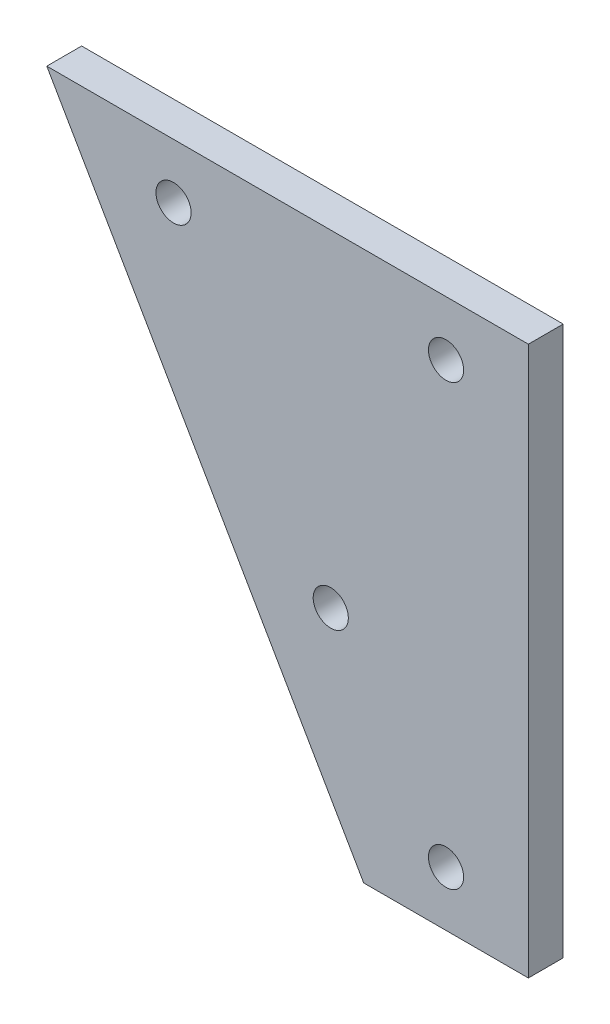
ISO-10303-21;
HEADER;
FILE_DESCRIPTION(('STEP AP214'),'2;1');
FILE_NAME('part.step','',(''),(''),'','','');
FILE_SCHEMA(('AUTOMOTIVE_DESIGN { 1 0 10303 214 1 1 1 1 }'));
ENDSEC;
DATA;
#1=APPLICATION_CONTEXT('core data for automotive mechanical design processes');
#2=APPLICATION_PROTOCOL_DEFINITION('international standard','automotive_design',2000,#1);
#3=PRODUCT_CONTEXT('',#1,'mechanical');
#4=PRODUCT('Part','Part','',(#3));
#5=PRODUCT_RELATED_PRODUCT_CATEGORY('part','',(#4));
#6=PRODUCT_DEFINITION_FORMATION('','',#4);
#7=PRODUCT_DEFINITION_CONTEXT('part definition',#1,'design');
#8=PRODUCT_DEFINITION('design','',#6,#7);
#9=PRODUCT_DEFINITION_SHAPE('','',#8);
#10=(LENGTH_UNIT() NAMED_UNIT(*) SI_UNIT(.MILLI.,.METRE.));
#11=(NAMED_UNIT(*) PLANE_ANGLE_UNIT() SI_UNIT($,.RADIAN.));
#12=(NAMED_UNIT(*) SI_UNIT($,.STERADIAN.) SOLID_ANGLE_UNIT());
#13=UNCERTAINTY_MEASURE_WITH_UNIT(LENGTH_MEASURE(1.E-05),#10,'distance_accuracy_value','');
#14=(GEOMETRIC_REPRESENTATION_CONTEXT(3) GLOBAL_UNCERTAINTY_ASSIGNED_CONTEXT((#13)) GLOBAL_UNIT_ASSIGNED_CONTEXT((#10,
#11,#12)) REPRESENTATION_CONTEXT('',''));
#15=CARTESIAN_POINT('',(0.,0.,0.));
#16=DIRECTION('',(0.,0.,1.));
#17=DIRECTION('',(1.,0.,0.));
#18=AXIS2_PLACEMENT_3D('',#15,#16,#17);
#19=CARTESIAN_POINT('',(0.,0.,3.175));
#20=DIRECTION('',(0.,0.,-1.));
#21=DIRECTION('',(-1.,0.,0.));
#22=AXIS2_PLACEMENT_3D('',#19,#20,#21);
#23=PLANE('',#22);
#24=DIRECTION('',(0.499999999999995,-0.866025403784441,0.));
#25=VECTOR('',#24,1.);
#26=CARTESIAN_POINT('',(28.8675134594809,-50.,3.175));
#27=LINE('',#26,#25);
#28=CARTESIAN_POINT('',(0.,0.,3.175));
#29=VERTEX_POINT('',#28);
#30=CARTESIAN_POINT('',(28.8675134594809,-50.,3.175));
#31=VERTEX_POINT('',#30);
#32=EDGE_CURVE('E98',#29,#31,#27,.T.);
#33=ORIENTED_EDGE('',*,*,#32,.T.);
#34=DIRECTION('',(1.,0.,0.));
#35=VECTOR('',#34,1.);
#36=CARTESIAN_POINT('',(43.8675134594809,-50.,3.175));
#37=LINE('',#36,#35);
#38=CARTESIAN_POINT('',(43.8675134594809,-50.,3.175));
#39=VERTEX_POINT('',#38);
#40=EDGE_CURVE('E93',#31,#39,#37,.T.);
#41=ORIENTED_EDGE('',*,*,#40,.T.);
#42=DIRECTION('',(0.,1.,0.));
#43=VECTOR('',#42,1.);
#44=CARTESIAN_POINT('',(43.8675134594809,0.,3.175));
#45=LINE('',#44,#43);
#46=CARTESIAN_POINT('',(43.8675134594809,0.,3.175));
#47=VERTEX_POINT('',#46);
#48=EDGE_CURVE('E96',#39,#47,#45,.T.);
#49=ORIENTED_EDGE('',*,*,#48,.T.);
#50=DIRECTION('',(-1.,0.,0.));
#51=VECTOR('',#50,1.);
#52=CARTESIAN_POINT('',(0.,0.,3.175));
#53=LINE('',#52,#51);
#54=EDGE_CURVE('E63',#47,#29,#53,.T.);
#55=ORIENTED_EDGE('',*,*,#54,.T.);
#56=EDGE_LOOP('',(#33,#41,#49,#55));
#57=FACE_BOUND('',#56,.T.);
#58=CARTESIAN_POINT('',(36.3675134594809,-5.,3.175));
#59=DIRECTION('',(0.,0.,1.));
#60=DIRECTION('',(1.,0.,0.));
#61=AXIS2_PLACEMENT_3D('',#58,#59,#60);
#62=CIRCLE('',#61,1.6);
#63=CARTESIAN_POINT('',(37.9675134594809,-5.,3.175));
#64=VERTEX_POINT('',#63);
#65=EDGE_CURVE('E118',#64,#64,#62,.T.);
#66=ORIENTED_EDGE('',*,*,#65,.F.);
#67=EDGE_LOOP('',(#66));
#68=FACE_BOUND('',#67,.T.);
#69=CARTESIAN_POINT('',(11.5470053837924,-5.,3.175));
#70=DIRECTION('',(0.,0.,1.));
#71=DIRECTION('',(1.,0.,0.));
#72=AXIS2_PLACEMENT_3D('',#69,#70,#71);
#73=CIRCLE('',#72,1.6);
#74=CARTESIAN_POINT('',(13.1470053837925,-5.,3.175));
#75=VERTEX_POINT('',#74);
#76=EDGE_CURVE('E140',#75,#75,#73,.T.);
#77=ORIENTED_EDGE('',*,*,#76,.F.);
#78=EDGE_LOOP('',(#77));
#79=FACE_BOUND('',#78,.T.);
#80=CARTESIAN_POINT('',(36.3675134594809,-45.,3.175));
#81=DIRECTION('',(0.,0.,1.));
#82=DIRECTION('',(1.,0.,0.));
#83=AXIS2_PLACEMENT_3D('',#80,#81,#82);
#84=CIRCLE('',#83,1.60000000000001);
#85=CARTESIAN_POINT('',(37.9675134594809,-45.,3.175));
#86=VERTEX_POINT('',#85);
#87=EDGE_CURVE('E148',#86,#86,#84,.T.);
#88=ORIENTED_EDGE('',*,*,#87,.F.);
#89=EDGE_LOOP('',(#88));
#90=FACE_BOUND('',#89,.T.);
#91=CARTESIAN_POINT('',(25.8675134594809,-29.8038475772932,3.175));
#92=DIRECTION('',(0.,0.,1.));
#93=DIRECTION('',(1.,0.,0.));
#94=AXIS2_PLACEMENT_3D('',#91,#92,#93);
#95=CIRCLE('',#94,1.60000000000002);
#96=CARTESIAN_POINT('',(27.4675134594809,-29.8038475772932,3.175));
#97=VERTEX_POINT('',#96);
#98=EDGE_CURVE('E156',#97,#97,#95,.T.);
#99=ORIENTED_EDGE('',*,*,#98,.F.);
#100=EDGE_LOOP('',(#99));
#101=FACE_BOUND('',#100,.T.);
#102=ADVANCED_FACE('F45',(#57,#68,#79,#90,#101),#23,.F.);
#103=CARTESIAN_POINT('',(0.,0.,0.));
#104=DIRECTION('',(0.,0.,-1.));
#105=DIRECTION('',(-1.,0.,0.));
#106=AXIS2_PLACEMENT_3D('',#103,#104,#105);
#107=PLANE('',#106);
#108=CARTESIAN_POINT('',(36.3675134594809,-45.,0.));
#109=DIRECTION('',(0.,0.,1.));
#110=DIRECTION('',(1.,0.,0.));
#111=AXIS2_PLACEMENT_3D('',#108,#109,#110);
#112=CIRCLE('',#111,1.60000000000001);
#113=CARTESIAN_POINT('',(37.9675134594809,-45.,0.));
#114=VERTEX_POINT('',#113);
#115=EDGE_CURVE('E152',#114,#114,#112,.T.);
#116=ORIENTED_EDGE('',*,*,#115,.T.);
#117=EDGE_LOOP('',(#116));
#118=FACE_BOUND('',#117,.T.);
#119=CARTESIAN_POINT('',(36.3675134594809,-5.,0.));
#120=DIRECTION('',(0.,0.,1.));
#121=DIRECTION('',(1.,0.,0.));
#122=AXIS2_PLACEMENT_3D('',#119,#120,#121);
#123=CIRCLE('',#122,1.6);
#124=CARTESIAN_POINT('',(37.9675134594809,-5.,0.));
#125=VERTEX_POINT('',#124);
#126=EDGE_CURVE('E136',#125,#125,#123,.T.);
#127=ORIENTED_EDGE('',*,*,#126,.T.);
#128=EDGE_LOOP('',(#127));
#129=FACE_BOUND('',#128,.T.);
#130=DIRECTION('',(0.499999999999995,-0.866025403784441,0.));
#131=VECTOR('',#130,1.);
#132=CARTESIAN_POINT('',(28.8675134594809,-50.,0.));
#133=LINE('',#132,#131);
#134=CARTESIAN_POINT('',(0.,0.,0.));
#135=VERTEX_POINT('',#134);
#136=CARTESIAN_POINT('',(28.8675134594809,-50.,0.));
#137=VERTEX_POINT('',#136);
#138=EDGE_CURVE('E114',#135,#137,#133,.T.);
#139=ORIENTED_EDGE('',*,*,#138,.F.);
#140=DIRECTION('',(-1.,0.,0.));
#141=VECTOR('',#140,1.);
#142=CARTESIAN_POINT('',(0.,0.,0.));
#143=LINE('',#142,#141);
#144=CARTESIAN_POINT('',(43.8675134594809,0.,0.));
#145=VERTEX_POINT('',#144);
#146=EDGE_CURVE('E86',#145,#135,#143,.T.);
#147=ORIENTED_EDGE('',*,*,#146,.F.);
#148=DIRECTION('',(0.,1.,0.));
#149=VECTOR('',#148,1.);
#150=CARTESIAN_POINT('',(43.8675134594809,0.,0.));
#151=LINE('',#150,#149);
#152=CARTESIAN_POINT('',(43.8675134594809,-50.,0.));
#153=VERTEX_POINT('',#152);
#154=EDGE_CURVE('E80',#153,#145,#151,.T.);
#155=ORIENTED_EDGE('',*,*,#154,.F.);
#156=DIRECTION('',(1.,0.,0.));
#157=VECTOR('',#156,1.);
#158=CARTESIAN_POINT('',(43.8675134594809,-50.,0.));
#159=LINE('',#158,#157);
#160=EDGE_CURVE('E103',#137,#153,#159,.T.);
#161=ORIENTED_EDGE('',*,*,#160,.F.);
#162=EDGE_LOOP('',(#139,#147,#155,#161));
#163=FACE_BOUND('',#162,.T.);
#164=CARTESIAN_POINT('',(11.5470053837924,-5.,0.));
#165=DIRECTION('',(0.,0.,1.));
#166=DIRECTION('',(1.,0.,0.));
#167=AXIS2_PLACEMENT_3D('',#164,#165,#166);
#168=CIRCLE('',#167,1.6);
#169=CARTESIAN_POINT('',(13.1470053837925,-5.,0.));
#170=VERTEX_POINT('',#169);
#171=EDGE_CURVE('E144',#170,#170,#168,.T.);
#172=ORIENTED_EDGE('',*,*,#171,.T.);
#173=EDGE_LOOP('',(#172));
#174=FACE_BOUND('',#173,.T.);
#175=CARTESIAN_POINT('',(25.8675134594809,-29.8038475772932,0.));
#176=DIRECTION('',(0.,0.,1.));
#177=DIRECTION('',(1.,0.,0.));
#178=AXIS2_PLACEMENT_3D('',#175,#176,#177);
#179=CIRCLE('',#178,1.60000000000002);
#180=CARTESIAN_POINT('',(27.4675134594809,-29.8038475772932,0.));
#181=VERTEX_POINT('',#180);
#182=EDGE_CURVE('E160',#181,#181,#179,.T.);
#183=ORIENTED_EDGE('',*,*,#182,.T.);
#184=EDGE_LOOP('',(#183));
#185=FACE_BOUND('',#184,.T.);
#186=ADVANCED_FACE('F131',(#118,#129,#163,#174,#185),#107,.T.);
#187=CARTESIAN_POINT('',(28.8675134594809,-50.,3.175));
#188=DIRECTION('',(0.866025403784441,0.499999999999995,0.));
#189=DIRECTION('',(-0.499999999999995,0.866025403784441,0.));
#190=AXIS2_PLACEMENT_3D('',#187,#188,#189);
#191=PLANE('',#190);
#192=ORIENTED_EDGE('',*,*,#138,.T.);
#193=DIRECTION('',(0.,0.,-1.));
#194=VECTOR('',#193,1.);
#195=CARTESIAN_POINT('',(28.8675134594809,-50.,3.175));
#196=LINE('',#195,#194);
#197=EDGE_CURVE('E11',#31,#137,#196,.T.);
#198=ORIENTED_EDGE('',*,*,#197,.F.);
#199=ORIENTED_EDGE('',*,*,#32,.F.);
#200=DIRECTION('',(0.,0.,-1.));
#201=VECTOR('',#200,1.);
#202=CARTESIAN_POINT('',(0.,0.,3.175));
#203=LINE('',#202,#201);
#204=EDGE_CURVE('E110',#29,#135,#203,.T.);
#205=ORIENTED_EDGE('',*,*,#204,.T.);
#206=EDGE_LOOP('',(#192,#198,#199,#205));
#207=FACE_BOUND('',#206,.T.);
#208=ADVANCED_FACE('F47',(#207),#191,.F.);
#209=CARTESIAN_POINT('',(43.8675134594809,-50.,3.175));
#210=DIRECTION('',(0.,1.,0.));
#211=DIRECTION('',(0.,0.,1.));
#212=AXIS2_PLACEMENT_3D('',#209,#210,#211);
#213=PLANE('',#212);
#214=ORIENTED_EDGE('',*,*,#160,.T.);
#215=DIRECTION('',(0.,0.,-1.));
#216=VECTOR('',#215,1.);
#217=CARTESIAN_POINT('',(43.8675134594809,-50.,3.175));
#218=LINE('',#217,#216);
#219=EDGE_CURVE('E55',#39,#153,#218,.T.);
#220=ORIENTED_EDGE('',*,*,#219,.F.);
#221=ORIENTED_EDGE('',*,*,#40,.F.);
#222=ORIENTED_EDGE('',*,*,#197,.T.);
#223=EDGE_LOOP('',(#214,#220,#221,#222));
#224=FACE_BOUND('',#223,.T.);
#225=ADVANCED_FACE('F102',(#224),#213,.F.);
#226=CARTESIAN_POINT('',(43.8675134594809,0.,3.175));
#227=DIRECTION('',(-1.,0.,0.));
#228=DIRECTION('',(0.,-1.,0.));
#229=AXIS2_PLACEMENT_3D('',#226,#227,#228);
#230=PLANE('',#229);
#231=ORIENTED_EDGE('',*,*,#154,.T.);
#232=DIRECTION('',(0.,0.,-1.));
#233=VECTOR('',#232,1.);
#234=CARTESIAN_POINT('',(43.8675134594809,0.,3.175));
#235=LINE('',#234,#233);
#236=EDGE_CURVE('E105',#47,#145,#235,.T.);
#237=ORIENTED_EDGE('',*,*,#236,.F.);
#238=ORIENTED_EDGE('',*,*,#48,.F.);
#239=ORIENTED_EDGE('',*,*,#219,.T.);
#240=EDGE_LOOP('',(#231,#237,#238,#239));
#241=FACE_BOUND('',#240,.T.);
#242=ADVANCED_FACE('F106',(#241),#230,.F.);
#243=CARTESIAN_POINT('',(0.,0.,3.175));
#244=DIRECTION('',(0.,-1.,0.));
#245=DIRECTION('',(0.,0.,-1.));
#246=AXIS2_PLACEMENT_3D('',#243,#244,#245);
#247=PLANE('',#246);
#248=ORIENTED_EDGE('',*,*,#146,.T.);
#249=ORIENTED_EDGE('',*,*,#204,.F.);
#250=ORIENTED_EDGE('',*,*,#54,.F.);
#251=ORIENTED_EDGE('',*,*,#236,.T.);
#252=EDGE_LOOP('',(#248,#249,#250,#251));
#253=FACE_BOUND('',#252,.T.);
#254=ADVANCED_FACE('F128',(#253),#247,.F.);
#255=CARTESIAN_POINT('',(36.3675134594809,-5.,3.175));
#256=DIRECTION('',(0.,0.,-1.));
#257=DIRECTION('',(-1.,0.,0.));
#258=AXIS2_PLACEMENT_3D('',#255,#256,#257);
#259=CYLINDRICAL_SURFACE('',#258,1.6);
#260=ORIENTED_EDGE('',*,*,#65,.T.);
#261=EDGE_LOOP('',(#260));
#262=FACE_BOUND('',#261,.T.);
#263=ORIENTED_EDGE('',*,*,#126,.F.);
#264=EDGE_LOOP('',(#263));
#265=FACE_BOUND('',#264,.T.);
#266=ADVANCED_FACE('F179',(#262,#265),#259,.F.);
#267=CARTESIAN_POINT('',(11.5470053837924,-5.,3.175));
#268=DIRECTION('',(0.,0.,-1.));
#269=DIRECTION('',(-1.,0.,0.));
#270=AXIS2_PLACEMENT_3D('',#267,#268,#269);
#271=CYLINDRICAL_SURFACE('',#270,1.6);
#272=ORIENTED_EDGE('',*,*,#76,.T.);
#273=EDGE_LOOP('',(#272));
#274=FACE_BOUND('',#273,.T.);
#275=ORIENTED_EDGE('',*,*,#171,.F.);
#276=EDGE_LOOP('',(#275));
#277=FACE_BOUND('',#276,.T.);
#278=ADVANCED_FACE('F224',(#274,#277),#271,.F.);
#279=CARTESIAN_POINT('',(36.3675134594809,-45.,3.175));
#280=DIRECTION('',(0.,0.,-1.));
#281=DIRECTION('',(-1.,0.,0.));
#282=AXIS2_PLACEMENT_3D('',#279,#280,#281);
#283=CYLINDRICAL_SURFACE('',#282,1.60000000000001);
#284=ORIENTED_EDGE('',*,*,#87,.T.);
#285=EDGE_LOOP('',(#284));
#286=FACE_BOUND('',#285,.T.);
#287=ORIENTED_EDGE('',*,*,#115,.F.);
#288=EDGE_LOOP('',(#287));
#289=FACE_BOUND('',#288,.T.);
#290=ADVANCED_FACE('F232',(#286,#289),#283,.F.);
#291=CARTESIAN_POINT('',(25.8675134594809,-29.8038475772932,3.175));
#292=DIRECTION('',(0.,0.,-1.));
#293=DIRECTION('',(-1.,0.,0.));
#294=AXIS2_PLACEMENT_3D('',#291,#292,#293);
#295=CYLINDRICAL_SURFACE('',#294,1.60000000000002);
#296=ORIENTED_EDGE('',*,*,#98,.T.);
#297=EDGE_LOOP('',(#296));
#298=FACE_BOUND('',#297,.T.);
#299=ORIENTED_EDGE('',*,*,#182,.F.);
#300=EDGE_LOOP('',(#299));
#301=FACE_BOUND('',#300,.T.);
#302=ADVANCED_FACE('F168',(#298,#301),#295,.F.);
#303=CLOSED_SHELL('',(#102,#186,#208,#225,#242,#254,#266,#278,#290,#302));
#304=MANIFOLD_SOLID_BREP('B2',#303);
#305=ADVANCED_BREP_SHAPE_REPRESENTATION('',(#18,#304),#14);
#306=SHAPE_DEFINITION_REPRESENTATION(#9,#305);
ENDSEC;
END-ISO-10303-21;
